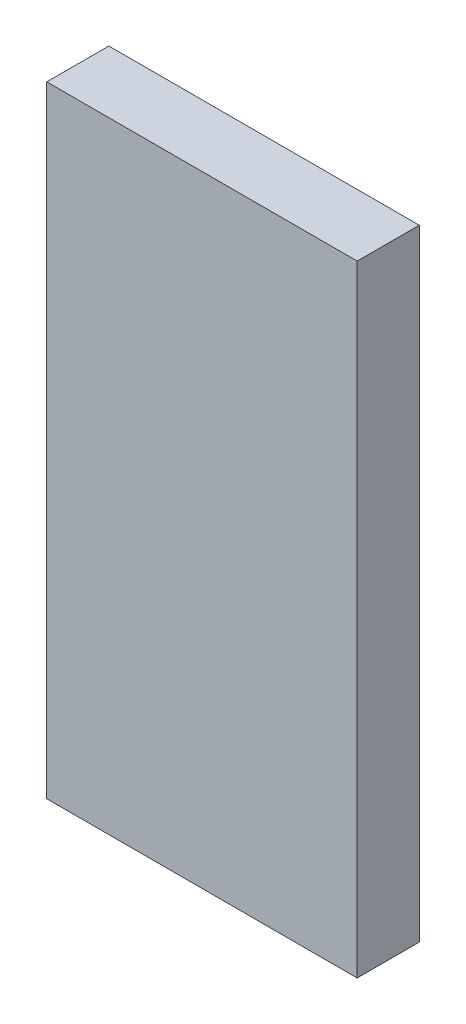
ISO-10303-21;
HEADER;
FILE_DESCRIPTION(('STEP AP214'),'2;1');
FILE_NAME('part.step','',(''),(''),'','','');
FILE_SCHEMA(('AUTOMOTIVE_DESIGN { 1 0 10303 214 1 1 1 1 }'));
ENDSEC;
DATA;
#1=APPLICATION_CONTEXT('core data for automotive mechanical design processes');
#2=APPLICATION_PROTOCOL_DEFINITION('international standard','automotive_design',2000,#1);
#3=PRODUCT_CONTEXT('',#1,'mechanical');
#4=PRODUCT('Part','Part','',(#3));
#5=PRODUCT_RELATED_PRODUCT_CATEGORY('part','',(#4));
#6=PRODUCT_DEFINITION_FORMATION('','',#4);
#7=PRODUCT_DEFINITION_CONTEXT('part definition',#1,'design');
#8=PRODUCT_DEFINITION('design','',#6,#7);
#9=PRODUCT_DEFINITION_SHAPE('','',#8);
#10=(LENGTH_UNIT() NAMED_UNIT(*) SI_UNIT(.MILLI.,.METRE.));
#11=(NAMED_UNIT(*) PLANE_ANGLE_UNIT() SI_UNIT($,.RADIAN.));
#12=(NAMED_UNIT(*) SI_UNIT($,.STERADIAN.) SOLID_ANGLE_UNIT());
#13=UNCERTAINTY_MEASURE_WITH_UNIT(LENGTH_MEASURE(1.E-05),#10,'distance_accuracy_value','');
#14=(GEOMETRIC_REPRESENTATION_CONTEXT(3) GLOBAL_UNCERTAINTY_ASSIGNED_CONTEXT((#13)) GLOBAL_UNIT_ASSIGNED_CONTEXT((#10,
#11,#12)) REPRESENTATION_CONTEXT('',''));
#15=CARTESIAN_POINT('',(0.,0.,0.));
#16=DIRECTION('',(0.,0.,1.));
#17=DIRECTION('',(1.,0.,0.));
#18=AXIS2_PLACEMENT_3D('',#15,#16,#17);
#19=CARTESIAN_POINT('',(30.,60.,12.));
#20=DIRECTION('',(-1.,0.,0.));
#21=DIRECTION('',(0.,-1.,0.));
#22=AXIS2_PLACEMENT_3D('',#19,#20,#21);
#23=PLANE('',#22);
#24=DIRECTION('',(0.,1.,0.));
#25=VECTOR('',#24,1.);
#26=CARTESIAN_POINT('',(30.,60.,0.));
#27=LINE('',#26,#25);
#28=CARTESIAN_POINT('',(30.,-60.,0.));
#29=VERTEX_POINT('',#28);
#30=CARTESIAN_POINT('',(30.,60.,0.));
#31=VERTEX_POINT('',#30);
#32=EDGE_CURVE('E96',#29,#31,#27,.T.);
#33=ORIENTED_EDGE('',*,*,#32,.T.);
#34=DIRECTION('',(0.,0.,-1.));
#35=VECTOR('',#34,1.);
#36=CARTESIAN_POINT('',(30.,60.,12.));
#37=LINE('',#36,#35);
#38=CARTESIAN_POINT('',(30.,60.,12.));
#39=VERTEX_POINT('',#38);
#40=EDGE_CURVE('E11',#39,#31,#37,.T.);
#41=ORIENTED_EDGE('',*,*,#40,.F.);
#42=DIRECTION('',(0.,1.,0.));
#43=VECTOR('',#42,1.);
#44=CARTESIAN_POINT('',(30.,60.,12.));
#45=LINE('',#44,#43);
#46=CARTESIAN_POINT('',(30.,-60.,12.));
#47=VERTEX_POINT('',#46);
#48=EDGE_CURVE('E84',#47,#39,#45,.T.);
#49=ORIENTED_EDGE('',*,*,#48,.F.);
#50=DIRECTION('',(0.,0.,-1.));
#51=VECTOR('',#50,1.);
#52=CARTESIAN_POINT('',(30.,-60.,12.));
#53=LINE('',#52,#51);
#54=EDGE_CURVE('E92',#47,#29,#53,.T.);
#55=ORIENTED_EDGE('',*,*,#54,.T.);
#56=EDGE_LOOP('',(#33,#41,#49,#55));
#57=FACE_BOUND('',#56,.T.);
#58=ADVANCED_FACE('F33',(#57),#23,.F.);
#59=CARTESIAN_POINT('',(-30.,60.,12.));
#60=DIRECTION('',(0.,-1.,0.));
#61=DIRECTION('',(0.,0.,-1.));
#62=AXIS2_PLACEMENT_3D('',#59,#60,#61);
#63=PLANE('',#62);
#64=DIRECTION('',(-1.,0.,0.));
#65=VECTOR('',#64,1.);
#66=CARTESIAN_POINT('',(-30.,60.,0.));
#67=LINE('',#66,#65);
#68=CARTESIAN_POINT('',(-30.,60.,0.));
#69=VERTEX_POINT('',#68);
#70=EDGE_CURVE('E88',#31,#69,#67,.T.);
#71=ORIENTED_EDGE('',*,*,#70,.T.);
#72=DIRECTION('',(0.,0.,-1.));
#73=VECTOR('',#72,1.);
#74=CARTESIAN_POINT('',(-30.,60.,12.));
#75=LINE('',#74,#73);
#76=CARTESIAN_POINT('',(-30.,60.,12.));
#77=VERTEX_POINT('',#76);
#78=EDGE_CURVE('E41',#77,#69,#75,.T.);
#79=ORIENTED_EDGE('',*,*,#78,.F.);
#80=DIRECTION('',(-1.,0.,0.));
#81=VECTOR('',#80,1.);
#82=CARTESIAN_POINT('',(-30.,60.,12.));
#83=LINE('',#82,#81);
#84=EDGE_CURVE('E79',#39,#77,#83,.T.);
#85=ORIENTED_EDGE('',*,*,#84,.F.);
#86=ORIENTED_EDGE('',*,*,#40,.T.);
#87=EDGE_LOOP('',(#71,#79,#85,#86));
#88=FACE_BOUND('',#87,.T.);
#89=ADVANCED_FACE('F87',(#88),#63,.F.);
#90=CARTESIAN_POINT('',(-30.,60.,12.));
#91=DIRECTION('',(1.,0.,0.));
#92=DIRECTION('',(0.,1.,0.));
#93=AXIS2_PLACEMENT_3D('',#90,#91,#92);
#94=PLANE('',#93);
#95=DIRECTION('',(0.,-1.,0.));
#96=VECTOR('',#95,1.);
#97=CARTESIAN_POINT('',(-30.,60.,0.));
#98=LINE('',#97,#96);
#99=CARTESIAN_POINT('',(-30.,-60.,0.));
#100=VERTEX_POINT('',#99);
#101=EDGE_CURVE('E66',#69,#100,#98,.T.);
#102=ORIENTED_EDGE('',*,*,#101,.T.);
#103=DIRECTION('',(0.,0.,-1.));
#104=VECTOR('',#103,1.);
#105=CARTESIAN_POINT('',(-30.,-60.,12.));
#106=LINE('',#105,#104);
#107=CARTESIAN_POINT('',(-30.,-60.,12.));
#108=VERTEX_POINT('',#107);
#109=EDGE_CURVE('E89',#108,#100,#106,.T.);
#110=ORIENTED_EDGE('',*,*,#109,.F.);
#111=DIRECTION('',(0.,-1.,0.));
#112=VECTOR('',#111,1.);
#113=CARTESIAN_POINT('',(-30.,60.,12.));
#114=LINE('',#113,#112);
#115=EDGE_CURVE('E82',#77,#108,#114,.T.);
#116=ORIENTED_EDGE('',*,*,#115,.F.);
#117=ORIENTED_EDGE('',*,*,#78,.T.);
#118=EDGE_LOOP('',(#102,#110,#116,#117));
#119=FACE_BOUND('',#118,.T.);
#120=ADVANCED_FACE('F90',(#119),#94,.F.);
#121=CARTESIAN_POINT('',(-30.,-60.,12.));
#122=DIRECTION('',(0.,1.,0.));
#123=DIRECTION('',(0.,0.,1.));
#124=AXIS2_PLACEMENT_3D('',#121,#122,#123);
#125=PLANE('',#124);
#126=DIRECTION('',(1.,0.,0.));
#127=VECTOR('',#126,1.);
#128=CARTESIAN_POINT('',(-30.,-60.,0.));
#129=LINE('',#128,#127);
#130=EDGE_CURVE('E72',#100,#29,#129,.T.);
#131=ORIENTED_EDGE('',*,*,#130,.T.);
#132=ORIENTED_EDGE('',*,*,#54,.F.);
#133=DIRECTION('',(1.,0.,0.));
#134=VECTOR('',#133,1.);
#135=CARTESIAN_POINT('',(-30.,-60.,12.));
#136=LINE('',#135,#134);
#137=EDGE_CURVE('E49',#108,#47,#136,.T.);
#138=ORIENTED_EDGE('',*,*,#137,.F.);
#139=ORIENTED_EDGE('',*,*,#109,.T.);
#140=EDGE_LOOP('',(#131,#132,#138,#139));
#141=FACE_BOUND('',#140,.T.);
#142=ADVANCED_FACE('F103',(#141),#125,.F.);
#143=CARTESIAN_POINT('',(0.,0.,12.));
#144=DIRECTION('',(0.,0.,1.));
#145=DIRECTION('',(1.,0.,0.));
#146=AXIS2_PLACEMENT_3D('',#143,#144,#145);
#147=PLANE('',#146);
#148=ORIENTED_EDGE('',*,*,#48,.T.);
#149=ORIENTED_EDGE('',*,*,#84,.T.);
#150=ORIENTED_EDGE('',*,*,#115,.T.);
#151=ORIENTED_EDGE('',*,*,#137,.T.);
#152=EDGE_LOOP('',(#148,#149,#150,#151));
#153=FACE_BOUND('',#152,.T.);
#154=ADVANCED_FACE('F80',(#153),#147,.T.);
#155=CARTESIAN_POINT('',(0.,0.,0.));
#156=DIRECTION('',(0.,0.,1.));
#157=DIRECTION('',(1.,0.,0.));
#158=AXIS2_PLACEMENT_3D('',#155,#156,#157);
#159=PLANE('',#158);
#160=ORIENTED_EDGE('',*,*,#32,.F.);
#161=ORIENTED_EDGE('',*,*,#130,.F.);
#162=ORIENTED_EDGE('',*,*,#101,.F.);
#163=ORIENTED_EDGE('',*,*,#70,.F.);
#164=EDGE_LOOP('',(#160,#161,#162,#163));
#165=FACE_BOUND('',#164,.T.);
#166=ADVANCED_FACE('F106',(#165),#159,.F.);
#167=CLOSED_SHELL('',(#58,#89,#120,#142,#154,#166));
#168=MANIFOLD_SOLID_BREP('B2',#167);
#169=ADVANCED_BREP_SHAPE_REPRESENTATION('',(#18,#168),#14);
#170=SHAPE_DEFINITION_REPRESENTATION(#9,#169);
ENDSEC;
END-ISO-10303-21;
